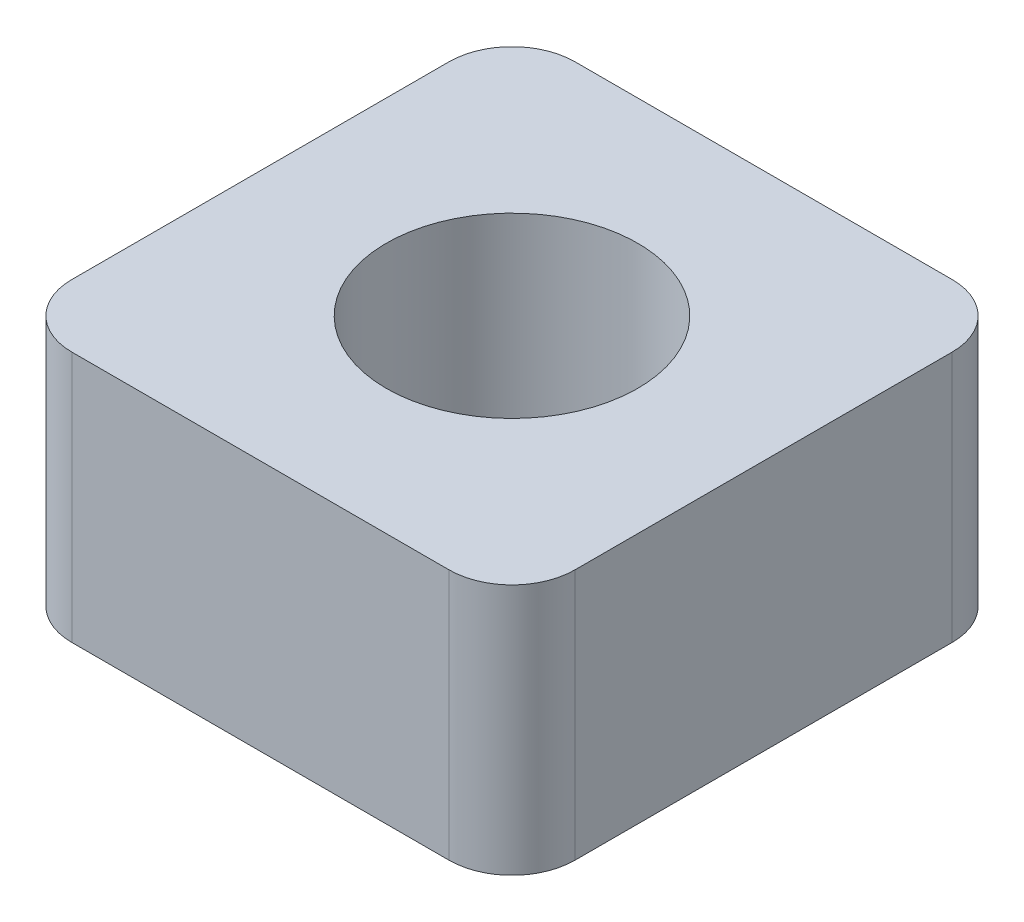
ISO-10303-21;
HEADER;
FILE_DESCRIPTION(('STEP AP214'),'2;1');
FILE_NAME('part.step','',(''),(''),'','','');
FILE_SCHEMA(('AUTOMOTIVE_DESIGN { 1 0 10303 214 1 1 1 1 }'));
ENDSEC;
DATA;
#1=APPLICATION_CONTEXT('core data for automotive mechanical design processes');
#2=APPLICATION_PROTOCOL_DEFINITION('international standard','automotive_design',2000,#1);
#3=PRODUCT_CONTEXT('',#1,'mechanical');
#4=PRODUCT('Part','Part','',(#3));
#5=PRODUCT_RELATED_PRODUCT_CATEGORY('part','',(#4));
#6=PRODUCT_DEFINITION_FORMATION('','',#4);
#7=PRODUCT_DEFINITION_CONTEXT('part definition',#1,'design');
#8=PRODUCT_DEFINITION('design','',#6,#7);
#9=PRODUCT_DEFINITION_SHAPE('','',#8);
#10=(LENGTH_UNIT() NAMED_UNIT(*) SI_UNIT(.MILLI.,.METRE.));
#11=(NAMED_UNIT(*) PLANE_ANGLE_UNIT() SI_UNIT($,.RADIAN.));
#12=(NAMED_UNIT(*) SI_UNIT($,.STERADIAN.) SOLID_ANGLE_UNIT());
#13=UNCERTAINTY_MEASURE_WITH_UNIT(LENGTH_MEASURE(1.E-05),#10,'distance_accuracy_value','');
#14=(GEOMETRIC_REPRESENTATION_CONTEXT(3) GLOBAL_UNCERTAINTY_ASSIGNED_CONTEXT((#13)) GLOBAL_UNIT_ASSIGNED_CONTEXT((#10,
#11,#12)) REPRESENTATION_CONTEXT('',''));
#15=CARTESIAN_POINT('',(0.,0.,0.));
#16=DIRECTION('',(0.,0.,1.));
#17=DIRECTION('',(1.,0.,0.));
#18=AXIS2_PLACEMENT_3D('',#15,#16,#17);
#19=CARTESIAN_POINT('',(0.,4.,0.));
#20=DIRECTION('',(0.,1.,0.));
#21=DIRECTION('',(0.,0.,1.));
#22=AXIS2_PLACEMENT_3D('',#19,#20,#21);
#23=PLANE('',#22);
#24=DIRECTION('',(1.,0.,0.));
#25=VECTOR('',#24,1.);
#26=CARTESIAN_POINT('',(-4.,4.,4.));
#27=LINE('',#26,#25);
#28=CARTESIAN_POINT('',(-3.,4.,4.));
#29=VERTEX_POINT('',#28);
#30=CARTESIAN_POINT('',(3.,4.,4.));
#31=VERTEX_POINT('',#30);
#32=EDGE_CURVE('E137',#29,#31,#27,.T.);
#33=ORIENTED_EDGE('',*,*,#32,.T.);
#34=CARTESIAN_POINT('',(3.,4.,3.));
#35=DIRECTION('',(0.,1.,0.));
#36=DIRECTION('',(0.,0.,1.));
#37=AXIS2_PLACEMENT_3D('',#34,#35,#36);
#38=CIRCLE('',#37,1.);
#39=CARTESIAN_POINT('',(4.,4.,3.));
#40=VERTEX_POINT('',#39);
#41=EDGE_CURVE('E156',#31,#40,#38,.T.);
#42=ORIENTED_EDGE('',*,*,#41,.T.);
#43=DIRECTION('',(0.,0.,-1.));
#44=VECTOR('',#43,1.);
#45=CARTESIAN_POINT('',(4.,4.,-4.));
#46=LINE('',#45,#44);
#47=CARTESIAN_POINT('',(4.,4.,-3.));
#48=VERTEX_POINT('',#47);
#49=EDGE_CURVE('E120',#40,#48,#46,.T.);
#50=ORIENTED_EDGE('',*,*,#49,.T.);
#51=CARTESIAN_POINT('',(3.,4.,-3.));
#52=DIRECTION('',(0.,1.,0.));
#53=DIRECTION('',(0.,0.,1.));
#54=AXIS2_PLACEMENT_3D('',#51,#52,#53);
#55=CIRCLE('',#54,1.);
#56=CARTESIAN_POINT('',(3.,4.,-4.));
#57=VERTEX_POINT('',#56);
#58=EDGE_CURVE('E154',#48,#57,#55,.T.);
#59=ORIENTED_EDGE('',*,*,#58,.T.);
#60=DIRECTION('',(-1.,0.,0.));
#61=VECTOR('',#60,1.);
#62=CARTESIAN_POINT('',(-4.,4.,-4.));
#63=LINE('',#62,#61);
#64=CARTESIAN_POINT('',(-3.,4.,-4.));
#65=VERTEX_POINT('',#64);
#66=EDGE_CURVE('E167',#57,#65,#63,.T.);
#67=ORIENTED_EDGE('',*,*,#66,.T.);
#68=CARTESIAN_POINT('',(-3.,4.,-3.));
#69=DIRECTION('',(0.,1.,0.));
#70=DIRECTION('',(0.,0.,1.));
#71=AXIS2_PLACEMENT_3D('',#68,#69,#70);
#72=CIRCLE('',#71,1.);
#73=CARTESIAN_POINT('',(-4.,4.,-3.));
#74=VERTEX_POINT('',#73);
#75=EDGE_CURVE('E55',#65,#74,#72,.T.);
#76=ORIENTED_EDGE('',*,*,#75,.T.);
#77=DIRECTION('',(0.,0.,1.));
#78=VECTOR('',#77,1.);
#79=CARTESIAN_POINT('',(-4.,4.,-4.));
#80=LINE('',#79,#78);
#81=CARTESIAN_POINT('',(-4.,4.,3.));
#82=VERTEX_POINT('',#81);
#83=EDGE_CURVE('E175',#74,#82,#80,.T.);
#84=ORIENTED_EDGE('',*,*,#83,.T.);
#85=CARTESIAN_POINT('',(-3.,4.,3.));
#86=DIRECTION('',(0.,1.,0.));
#87=DIRECTION('',(0.,0.,1.));
#88=AXIS2_PLACEMENT_3D('',#85,#86,#87);
#89=CIRCLE('',#88,1.);
#90=EDGE_CURVE('E151',#82,#29,#89,.T.);
#91=ORIENTED_EDGE('',*,*,#90,.T.);
#92=EDGE_LOOP('',(#33,#42,#50,#59,#67,#76,#84,#91));
#93=FACE_BOUND('',#92,.T.);
#94=CARTESIAN_POINT('',(0.,4.,0.));
#95=DIRECTION('',(0.,1.,0.));
#96=DIRECTION('',(0.,0.,1.));
#97=AXIS2_PLACEMENT_3D('',#94,#95,#96);
#98=CIRCLE('',#97,2.);
#99=CARTESIAN_POINT('',(0.,4.,2.));
#100=VERTEX_POINT('',#99);
#101=EDGE_CURVE('E128',#100,#100,#98,.T.);
#102=ORIENTED_EDGE('',*,*,#101,.F.);
#103=EDGE_LOOP('',(#102));
#104=FACE_BOUND('',#103,.T.);
#105=ADVANCED_FACE('F34',(#93,#104),#23,.T.);
#106=CARTESIAN_POINT('',(0.,0.,0.));
#107=DIRECTION('',(0.,1.,0.));
#108=DIRECTION('',(0.,0.,1.));
#109=AXIS2_PLACEMENT_3D('',#106,#107,#108);
#110=PLANE('',#109);
#111=DIRECTION('',(0.,0.,-1.));
#112=VECTOR('',#111,1.);
#113=CARTESIAN_POINT('',(4.,0.,-4.));
#114=LINE('',#113,#112);
#115=CARTESIAN_POINT('',(4.,0.,3.));
#116=VERTEX_POINT('',#115);
#117=CARTESIAN_POINT('',(4.,0.,-3.));
#118=VERTEX_POINT('',#117);
#119=EDGE_CURVE('E117',#116,#118,#114,.T.);
#120=ORIENTED_EDGE('',*,*,#119,.F.);
#121=CARTESIAN_POINT('',(3.,0.,3.));
#122=DIRECTION('',(0.,1.,0.));
#123=DIRECTION('',(0.,0.,1.));
#124=AXIS2_PLACEMENT_3D('',#121,#122,#123);
#125=CIRCLE('',#124,1.);
#126=CARTESIAN_POINT('',(3.,0.,4.));
#127=VERTEX_POINT('',#126);
#128=EDGE_CURVE('E100',#116,#127,#125,.F.);
#129=ORIENTED_EDGE('',*,*,#128,.T.);
#130=DIRECTION('',(1.,0.,0.));
#131=VECTOR('',#130,1.);
#132=CARTESIAN_POINT('',(-4.,0.,4.));
#133=LINE('',#132,#131);
#134=CARTESIAN_POINT('',(-3.,0.,4.));
#135=VERTEX_POINT('',#134);
#136=EDGE_CURVE('E141',#135,#127,#133,.T.);
#137=ORIENTED_EDGE('',*,*,#136,.F.);
#138=CARTESIAN_POINT('',(-3.,0.,3.));
#139=DIRECTION('',(0.,1.,0.));
#140=DIRECTION('',(0.,0.,1.));
#141=AXIS2_PLACEMENT_3D('',#138,#139,#140);
#142=CIRCLE('',#141,1.);
#143=CARTESIAN_POINT('',(-4.,0.,3.));
#144=VERTEX_POINT('',#143);
#145=EDGE_CURVE('E121',#135,#144,#142,.F.);
#146=ORIENTED_EDGE('',*,*,#145,.T.);
#147=DIRECTION('',(0.,0.,1.));
#148=VECTOR('',#147,1.);
#149=CARTESIAN_POINT('',(-4.,0.,-4.));
#150=LINE('',#149,#148);
#151=CARTESIAN_POINT('',(-4.,0.,-3.));
#152=VERTEX_POINT('',#151);
#153=EDGE_CURVE('E131',#152,#144,#150,.T.);
#154=ORIENTED_EDGE('',*,*,#153,.F.);
#155=CARTESIAN_POINT('',(-3.,0.,-3.));
#156=DIRECTION('',(0.,1.,0.));
#157=DIRECTION('',(0.,0.,1.));
#158=AXIS2_PLACEMENT_3D('',#155,#156,#157);
#159=CIRCLE('',#158,1.);
#160=CARTESIAN_POINT('',(-3.,0.,-4.));
#161=VERTEX_POINT('',#160);
#162=EDGE_CURVE('E145',#152,#161,#159,.F.);
#163=ORIENTED_EDGE('',*,*,#162,.T.);
#164=DIRECTION('',(-1.,0.,0.));
#165=VECTOR('',#164,1.);
#166=CARTESIAN_POINT('',(-4.,0.,-4.));
#167=LINE('',#166,#165);
#168=CARTESIAN_POINT('',(3.,0.,-4.));
#169=VERTEX_POINT('',#168);
#170=EDGE_CURVE('E127',#169,#161,#167,.T.);
#171=ORIENTED_EDGE('',*,*,#170,.F.);
#172=CARTESIAN_POINT('',(3.,0.,-3.));
#173=DIRECTION('',(0.,1.,0.));
#174=DIRECTION('',(0.,0.,1.));
#175=AXIS2_PLACEMENT_3D('',#172,#173,#174);
#176=CIRCLE('',#175,1.);
#177=EDGE_CURVE('E111',#169,#118,#176,.F.);
#178=ORIENTED_EDGE('',*,*,#177,.T.);
#179=EDGE_LOOP('',(#120,#129,#137,#146,#154,#163,#171,#178));
#180=FACE_BOUND('',#179,.T.);
#181=CARTESIAN_POINT('',(0.,0.,0.));
#182=DIRECTION('',(0.,1.,0.));
#183=DIRECTION('',(0.,0.,1.));
#184=AXIS2_PLACEMENT_3D('',#181,#182,#183);
#185=CIRCLE('',#184,2.);
#186=CARTESIAN_POINT('',(0.,0.,2.));
#187=VERTEX_POINT('',#186);
#188=EDGE_CURVE('E134',#187,#187,#185,.T.);
#189=ORIENTED_EDGE('',*,*,#188,.T.);
#190=EDGE_LOOP('',(#189));
#191=FACE_BOUND('',#190,.T.);
#192=ADVANCED_FACE('F124',(#180,#191),#110,.F.);
#193=CARTESIAN_POINT('',(4.,4.,-4.));
#194=DIRECTION('',(-1.,0.,0.));
#195=DIRECTION('',(0.,0.,1.));
#196=AXIS2_PLACEMENT_3D('',#193,#194,#195);
#197=PLANE('',#196);
#198=ORIENTED_EDGE('',*,*,#49,.F.);
#199=DIRECTION('',(0.,-1.,0.));
#200=VECTOR('',#199,1.);
#201=CARTESIAN_POINT('',(4.,4.,3.));
#202=LINE('',#201,#200);
#203=EDGE_CURVE('E104',#40,#116,#202,.T.);
#204=ORIENTED_EDGE('',*,*,#203,.T.);
#205=ORIENTED_EDGE('',*,*,#119,.T.);
#206=DIRECTION('',(0.,-1.,0.));
#207=VECTOR('',#206,1.);
#208=CARTESIAN_POINT('',(4.,4.,-3.));
#209=LINE('',#208,#207);
#210=EDGE_CURVE('E122',#118,#48,#209,.F.);
#211=ORIENTED_EDGE('',*,*,#210,.T.);
#212=EDGE_LOOP('',(#198,#204,#205,#211));
#213=FACE_BOUND('',#212,.T.);
#214=ADVANCED_FACE('F116',(#213),#197,.F.);
#215=CARTESIAN_POINT('',(-4.,4.,-4.));
#216=DIRECTION('',(0.,0.,1.));
#217=DIRECTION('',(1.,0.,0.));
#218=AXIS2_PLACEMENT_3D('',#215,#216,#217);
#219=PLANE('',#218);
#220=ORIENTED_EDGE('',*,*,#66,.F.);
#221=DIRECTION('',(0.,-1.,0.));
#222=VECTOR('',#221,1.);
#223=CARTESIAN_POINT('',(3.,4.,-4.));
#224=LINE('',#223,#222);
#225=EDGE_CURVE('E160',#57,#169,#224,.T.);
#226=ORIENTED_EDGE('',*,*,#225,.T.);
#227=ORIENTED_EDGE('',*,*,#170,.T.);
#228=DIRECTION('',(0.,-1.,0.));
#229=VECTOR('',#228,1.);
#230=CARTESIAN_POINT('',(-3.,4.,-4.));
#231=LINE('',#230,#229);
#232=EDGE_CURVE('E158',#161,#65,#231,.F.);
#233=ORIENTED_EDGE('',*,*,#232,.T.);
#234=EDGE_LOOP('',(#220,#226,#227,#233));
#235=FACE_BOUND('',#234,.T.);
#236=ADVANCED_FACE('F165',(#235),#219,.F.);
#237=CARTESIAN_POINT('',(-4.,4.,-4.));
#238=DIRECTION('',(1.,0.,0.));
#239=DIRECTION('',(0.,0.,-1.));
#240=AXIS2_PLACEMENT_3D('',#237,#238,#239);
#241=PLANE('',#240);
#242=ORIENTED_EDGE('',*,*,#83,.F.);
#243=DIRECTION('',(0.,-1.,0.));
#244=VECTOR('',#243,1.);
#245=CARTESIAN_POINT('',(-4.,4.,-3.));
#246=LINE('',#245,#244);
#247=EDGE_CURVE('E11',#74,#152,#246,.T.);
#248=ORIENTED_EDGE('',*,*,#247,.T.);
#249=ORIENTED_EDGE('',*,*,#153,.T.);
#250=DIRECTION('',(0.,-1.,0.));
#251=VECTOR('',#250,1.);
#252=CARTESIAN_POINT('',(-4.,4.,3.));
#253=LINE('',#252,#251);
#254=EDGE_CURVE('E42',#144,#82,#253,.F.);
#255=ORIENTED_EDGE('',*,*,#254,.T.);
#256=EDGE_LOOP('',(#242,#248,#249,#255));
#257=FACE_BOUND('',#256,.T.);
#258=ADVANCED_FACE('F174',(#257),#241,.F.);
#259=CARTESIAN_POINT('',(-4.,4.,4.));
#260=DIRECTION('',(0.,0.,-1.));
#261=DIRECTION('',(-1.,0.,0.));
#262=AXIS2_PLACEMENT_3D('',#259,#260,#261);
#263=PLANE('',#262);
#264=ORIENTED_EDGE('',*,*,#136,.T.);
#265=DIRECTION('',(0.,-1.,0.));
#266=VECTOR('',#265,1.);
#267=CARTESIAN_POINT('',(3.,4.,4.));
#268=LINE('',#267,#266);
#269=EDGE_CURVE('E105',#127,#31,#268,.F.);
#270=ORIENTED_EDGE('',*,*,#269,.T.);
#271=ORIENTED_EDGE('',*,*,#32,.F.);
#272=DIRECTION('',(0.,-1.,0.));
#273=VECTOR('',#272,1.);
#274=CARTESIAN_POINT('',(-3.,4.,4.));
#275=LINE('',#274,#273);
#276=EDGE_CURVE('E110',#29,#135,#275,.T.);
#277=ORIENTED_EDGE('',*,*,#276,.T.);
#278=EDGE_LOOP('',(#264,#270,#271,#277));
#279=FACE_BOUND('',#278,.T.);
#280=ADVANCED_FACE('F186',(#279),#263,.F.);
#281=CARTESIAN_POINT('',(0.,4.,0.));
#282=DIRECTION('',(0.,-1.,0.));
#283=DIRECTION('',(0.,0.,-1.));
#284=AXIS2_PLACEMENT_3D('',#281,#282,#283);
#285=CYLINDRICAL_SURFACE('',#284,2.);
#286=ORIENTED_EDGE('',*,*,#101,.T.);
#287=EDGE_LOOP('',(#286));
#288=FACE_BOUND('',#287,.T.);
#289=ORIENTED_EDGE('',*,*,#188,.F.);
#290=EDGE_LOOP('',(#289));
#291=FACE_BOUND('',#290,.T.);
#292=ADVANCED_FACE('F184',(#288,#291),#285,.F.);
#293=CARTESIAN_POINT('',(3.,4.,3.));
#294=DIRECTION('',(0.,-1.,0.));
#295=DIRECTION('',(0.,0.,-1.));
#296=AXIS2_PLACEMENT_3D('',#293,#294,#295);
#297=CYLINDRICAL_SURFACE('',#296,1.);
#298=ORIENTED_EDGE('',*,*,#41,.F.);
#299=ORIENTED_EDGE('',*,*,#269,.F.);
#300=ORIENTED_EDGE('',*,*,#128,.F.);
#301=ORIENTED_EDGE('',*,*,#203,.F.);
#302=EDGE_LOOP('',(#298,#299,#300,#301));
#303=FACE_BOUND('',#302,.T.);
#304=ADVANCED_FACE('F103',(#303),#297,.T.);
#305=CARTESIAN_POINT('',(3.,4.,-3.));
#306=DIRECTION('',(0.,-1.,0.));
#307=DIRECTION('',(0.,0.,-1.));
#308=AXIS2_PLACEMENT_3D('',#305,#306,#307);
#309=CYLINDRICAL_SURFACE('',#308,1.);
#310=ORIENTED_EDGE('',*,*,#58,.F.);
#311=ORIENTED_EDGE('',*,*,#210,.F.);
#312=ORIENTED_EDGE('',*,*,#177,.F.);
#313=ORIENTED_EDGE('',*,*,#225,.F.);
#314=EDGE_LOOP('',(#310,#311,#312,#313));
#315=FACE_BOUND('',#314,.T.);
#316=ADVANCED_FACE('F193',(#315),#309,.T.);
#317=CARTESIAN_POINT('',(-3.,4.,-3.));
#318=DIRECTION('',(0.,-1.,0.));
#319=DIRECTION('',(0.,0.,-1.));
#320=AXIS2_PLACEMENT_3D('',#317,#318,#319);
#321=CYLINDRICAL_SURFACE('',#320,1.);
#322=ORIENTED_EDGE('',*,*,#75,.F.);
#323=ORIENTED_EDGE('',*,*,#232,.F.);
#324=ORIENTED_EDGE('',*,*,#162,.F.);
#325=ORIENTED_EDGE('',*,*,#247,.F.);
#326=EDGE_LOOP('',(#322,#323,#324,#325));
#327=FACE_BOUND('',#326,.T.);
#328=ADVANCED_FACE('F173',(#327),#321,.T.);
#329=CARTESIAN_POINT('',(-3.,4.,3.));
#330=DIRECTION('',(0.,-1.,0.));
#331=DIRECTION('',(0.,0.,-1.));
#332=AXIS2_PLACEMENT_3D('',#329,#330,#331);
#333=CYLINDRICAL_SURFACE('',#332,1.);
#334=ORIENTED_EDGE('',*,*,#90,.F.);
#335=ORIENTED_EDGE('',*,*,#254,.F.);
#336=ORIENTED_EDGE('',*,*,#145,.F.);
#337=ORIENTED_EDGE('',*,*,#276,.F.);
#338=EDGE_LOOP('',(#334,#335,#336,#337));
#339=FACE_BOUND('',#338,.T.);
#340=ADVANCED_FACE('F36',(#339),#333,.T.);
#341=CLOSED_SHELL('',(#105,#192,#214,#236,#258,#280,#292,#304,#316,#328,#340));
#342=MANIFOLD_SOLID_BREP('B2',#341);
#343=ADVANCED_BREP_SHAPE_REPRESENTATION('',(#18,#342),#14);
#344=SHAPE_DEFINITION_REPRESENTATION(#9,#343);
ENDSEC;
END-ISO-10303-21;
